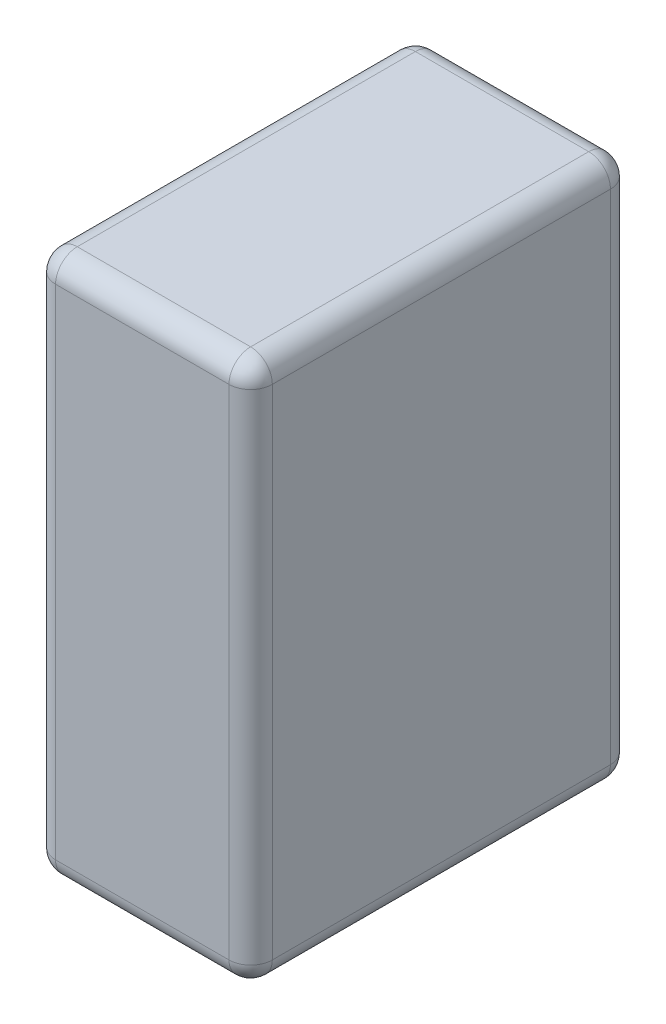
ISO-10303-21;
HEADER;
FILE_DESCRIPTION(('STEP AP214'),'2;1');
FILE_NAME('part.step','',(''),(''),'','','');
FILE_SCHEMA(('AUTOMOTIVE_DESIGN { 1 0 10303 214 1 1 1 1 }'));
ENDSEC;
DATA;
#1=APPLICATION_CONTEXT('core data for automotive mechanical design processes');
#2=APPLICATION_PROTOCOL_DEFINITION('international standard','automotive_design',2000,#1);
#3=PRODUCT_CONTEXT('',#1,'mechanical');
#4=PRODUCT('Part','Part','',(#3));
#5=PRODUCT_RELATED_PRODUCT_CATEGORY('part','',(#4));
#6=PRODUCT_DEFINITION_FORMATION('','',#4);
#7=PRODUCT_DEFINITION_CONTEXT('part definition',#1,'design');
#8=PRODUCT_DEFINITION('design','',#6,#7);
#9=PRODUCT_DEFINITION_SHAPE('','',#8);
#10=(LENGTH_UNIT() NAMED_UNIT(*) SI_UNIT(.MILLI.,.METRE.));
#11=(NAMED_UNIT(*) PLANE_ANGLE_UNIT() SI_UNIT($,.RADIAN.));
#12=(NAMED_UNIT(*) SI_UNIT($,.STERADIAN.) SOLID_ANGLE_UNIT());
#13=UNCERTAINTY_MEASURE_WITH_UNIT(LENGTH_MEASURE(1.E-05),#10,'distance_accuracy_value','');
#14=(GEOMETRIC_REPRESENTATION_CONTEXT(3) GLOBAL_UNCERTAINTY_ASSIGNED_CONTEXT((#13)) GLOBAL_UNIT_ASSIGNED_CONTEXT((#10,
#11,#12)) REPRESENTATION_CONTEXT('',''));
#15=CARTESIAN_POINT('',(0.,0.,0.));
#16=DIRECTION('',(0.,0.,1.));
#17=DIRECTION('',(1.,0.,0.));
#18=AXIS2_PLACEMENT_3D('',#15,#16,#17);
#19=CARTESIAN_POINT('',(-1.,-0.625,0.));
#20=DIRECTION('',(1.,0.,0.));
#21=DIRECTION('',(0.,0.,1.));
#22=AXIS2_PLACEMENT_3D('',#19,#20,#21);
#23=PLANE('',#22);
#24=DIRECTION('',(0.,1.,0.));
#25=VECTOR('',#24,1.);
#26=CARTESIAN_POINT('',(-1.,-0.575,0.83));
#27=LINE('',#26,#25);
#28=CARTESIAN_POINT('',(-1.,-0.575,0.83));
#29=VERTEX_POINT('',#28);
#30=CARTESIAN_POINT('',(-1.,0.575,0.83));
#31=VERTEX_POINT('',#30);
#32=EDGE_CURVE('E11',#29,#31,#27,.T.);
#33=ORIENTED_EDGE('',*,*,#32,.T.);
#34=DIRECTION('',(0.,0.,1.));
#35=VECTOR('',#34,1.);
#36=CARTESIAN_POINT('',(-1.,0.575,0.05));
#37=LINE('',#36,#35);
#38=CARTESIAN_POINT('',(-1.,0.575,0.05));
#39=VERTEX_POINT('',#38);
#40=EDGE_CURVE('E241',#39,#31,#37,.T.);
#41=ORIENTED_EDGE('',*,*,#40,.F.);
#42=DIRECTION('',(0.,1.,0.));
#43=VECTOR('',#42,1.);
#44=CARTESIAN_POINT('',(-1.,-0.575,0.05));
#45=LINE('',#44,#43);
#46=CARTESIAN_POINT('',(-1.,-0.575,0.05));
#47=VERTEX_POINT('',#46);
#48=EDGE_CURVE('E238',#47,#39,#45,.T.);
#49=ORIENTED_EDGE('',*,*,#48,.F.);
#50=DIRECTION('',(0.,0.,1.));
#51=VECTOR('',#50,1.);
#52=CARTESIAN_POINT('',(-1.,-0.575,0.05));
#53=LINE('',#52,#51);
#54=EDGE_CURVE('E24',#47,#29,#53,.T.);
#55=ORIENTED_EDGE('',*,*,#54,.T.);
#56=EDGE_LOOP('',(#33,#41,#49,#55));
#57=FACE_BOUND('',#56,.T.);
#58=ADVANCED_FACE('F17',(#57),#23,.F.);
#59=CARTESIAN_POINT('',(-0.95,-0.575,0.));
#60=DIRECTION('',(0.,0.,1.));
#61=DIRECTION('',(-1.,0.,0.));
#62=AXIS2_PLACEMENT_3D('',#59,#60,#61);
#63=CYLINDRICAL_SURFACE('',#62,0.05);
#64=ORIENTED_EDGE('',*,*,#54,.F.);
#65=CARTESIAN_POINT('',(-0.95,-0.575,0.05));
#66=DIRECTION('',(0.,0.,1.));
#67=DIRECTION('',(-1.,0.,0.));
#68=AXIS2_PLACEMENT_3D('',#65,#66,#67);
#69=CIRCLE('',#68,0.05);
#70=CARTESIAN_POINT('',(-0.95,-0.625,0.05));
#71=VERTEX_POINT('',#70);
#72=EDGE_CURVE('E236',#47,#71,#69,.T.);
#73=ORIENTED_EDGE('',*,*,#72,.T.);
#74=DIRECTION('',(0.,0.,1.));
#75=VECTOR('',#74,1.);
#76=CARTESIAN_POINT('',(-0.95,-0.625,0.05));
#77=LINE('',#76,#75);
#78=CARTESIAN_POINT('',(-0.95,-0.625,0.83));
#79=VERTEX_POINT('',#78);
#80=EDGE_CURVE('E228',#71,#79,#77,.T.);
#81=ORIENTED_EDGE('',*,*,#80,.T.);
#82=CARTESIAN_POINT('',(-0.95,-0.575,0.83));
#83=DIRECTION('',(0.,0.,1.));
#84=DIRECTION('',(-1.,0.,0.));
#85=AXIS2_PLACEMENT_3D('',#82,#83,#84);
#86=CIRCLE('',#85,0.05);
#87=EDGE_CURVE('E217',#29,#79,#86,.T.);
#88=ORIENTED_EDGE('',*,*,#87,.F.);
#89=EDGE_LOOP('',(#64,#73,#81,#88));
#90=FACE_BOUND('',#89,.T.);
#91=ADVANCED_FACE('F243',(#90),#63,.T.);
#92=CARTESIAN_POINT('',(-0.95,-0.625,0.05));
#93=DIRECTION('',(0.,1.,0.));
#94=DIRECTION('',(-1.,0.,0.));
#95=AXIS2_PLACEMENT_3D('',#92,#93,#94);
#96=CYLINDRICAL_SURFACE('',#95,0.05);
#97=ORIENTED_EDGE('',*,*,#48,.T.);
#98=CARTESIAN_POINT('',(-0.95,0.575,0.05));
#99=DIRECTION('',(0.,1.,0.));
#100=DIRECTION('',(0.,0.,-1.));
#101=AXIS2_PLACEMENT_3D('',#98,#99,#100);
#102=CIRCLE('',#101,0.05);
#103=CARTESIAN_POINT('',(-0.95,0.575,0.));
#104=VERTEX_POINT('',#103);
#105=EDGE_CURVE('E230',#104,#39,#102,.T.);
#106=ORIENTED_EDGE('',*,*,#105,.F.);
#107=DIRECTION('',(0.,1.,0.));
#108=VECTOR('',#107,1.);
#109=CARTESIAN_POINT('',(-0.95,-0.575,0.));
#110=LINE('',#109,#108);
#111=CARTESIAN_POINT('',(-0.95,-0.575,0.));
#112=VERTEX_POINT('',#111);
#113=EDGE_CURVE('E220',#112,#104,#110,.T.);
#114=ORIENTED_EDGE('',*,*,#113,.F.);
#115=CARTESIAN_POINT('',(-0.95,-0.575,0.05));
#116=DIRECTION('',(0.,1.,0.));
#117=DIRECTION('',(0.,0.,-1.));
#118=AXIS2_PLACEMENT_3D('',#115,#116,#117);
#119=CIRCLE('',#118,0.05);
#120=EDGE_CURVE('E205',#112,#47,#119,.T.);
#121=ORIENTED_EDGE('',*,*,#120,.T.);
#122=EDGE_LOOP('',(#97,#106,#114,#121));
#123=FACE_BOUND('',#122,.T.);
#124=ADVANCED_FACE('F270',(#123),#96,.T.);
#125=CARTESIAN_POINT('',(-0.95,-0.625,0.83));
#126=DIRECTION('',(0.,1.,0.));
#127=DIRECTION('',(-1.,0.,0.));
#128=AXIS2_PLACEMENT_3D('',#125,#126,#127);
#129=CYLINDRICAL_SURFACE('',#128,0.05);
#130=CARTESIAN_POINT('',(-0.95,-0.575,0.83));
#131=DIRECTION('',(0.,-1.,0.));
#132=DIRECTION('',(0.,0.,1.));
#133=AXIS2_PLACEMENT_3D('',#130,#131,#132);
#134=CIRCLE('',#133,0.05);
#135=CARTESIAN_POINT('',(-0.95,-0.575,0.88));
#136=VERTEX_POINT('',#135);
#137=EDGE_CURVE('E233',#136,#29,#134,.T.);
#138=ORIENTED_EDGE('',*,*,#137,.F.);
#139=DIRECTION('',(0.,1.,0.));
#140=VECTOR('',#139,1.);
#141=CARTESIAN_POINT('',(-0.95,-0.575,0.88));
#142=LINE('',#141,#140);
#143=CARTESIAN_POINT('',(-0.95,0.575,0.88));
#144=VERTEX_POINT('',#143);
#145=EDGE_CURVE('E223',#136,#144,#142,.T.);
#146=ORIENTED_EDGE('',*,*,#145,.T.);
#147=CARTESIAN_POINT('',(-0.95,0.575,0.83));
#148=DIRECTION('',(0.,1.,0.));
#149=DIRECTION('',(-1.,0.,0.));
#150=AXIS2_PLACEMENT_3D('',#147,#148,#149);
#151=CIRCLE('',#150,0.05);
#152=EDGE_CURVE('E208',#31,#144,#151,.T.);
#153=ORIENTED_EDGE('',*,*,#152,.F.);
#154=ORIENTED_EDGE('',*,*,#32,.F.);
#155=EDGE_LOOP('',(#138,#146,#153,#154));
#156=FACE_BOUND('',#155,.T.);
#157=ADVANCED_FACE('F251',(#156),#129,.T.);
#158=CARTESIAN_POINT('',(-0.95,0.575,0.));
#159=DIRECTION('',(0.,0.,1.));
#160=DIRECTION('',(-1.,0.,0.));
#161=AXIS2_PLACEMENT_3D('',#158,#159,#160);
#162=CYLINDRICAL_SURFACE('',#161,0.05);
#163=CARTESIAN_POINT('',(-0.95,0.575,0.83));
#164=DIRECTION('',(0.,0.,1.));
#165=DIRECTION('',(0.,1.,0.));
#166=AXIS2_PLACEMENT_3D('',#163,#164,#165);
#167=CIRCLE('',#166,0.05);
#168=CARTESIAN_POINT('',(-0.95,0.625,0.83));
#169=VERTEX_POINT('',#168);
#170=EDGE_CURVE('E225',#169,#31,#167,.T.);
#171=ORIENTED_EDGE('',*,*,#170,.F.);
#172=DIRECTION('',(0.,0.,1.));
#173=VECTOR('',#172,1.);
#174=CARTESIAN_POINT('',(-0.95,0.625,0.05));
#175=LINE('',#174,#173);
#176=CARTESIAN_POINT('',(-0.95,0.625,0.05));
#177=VERTEX_POINT('',#176);
#178=EDGE_CURVE('E211',#177,#169,#175,.T.);
#179=ORIENTED_EDGE('',*,*,#178,.F.);
#180=CARTESIAN_POINT('',(-0.95,0.575,0.05));
#181=DIRECTION('',(0.,0.,-1.));
#182=DIRECTION('',(-1.,0.,0.));
#183=AXIS2_PLACEMENT_3D('',#180,#181,#182);
#184=CIRCLE('',#183,0.05);
#185=EDGE_CURVE('E202',#39,#177,#184,.T.);
#186=ORIENTED_EDGE('',*,*,#185,.F.);
#187=ORIENTED_EDGE('',*,*,#40,.T.);
#188=EDGE_LOOP('',(#171,#179,#186,#187));
#189=FACE_BOUND('',#188,.T.);
#190=ADVANCED_FACE('F257',(#189),#162,.T.);
#191=CARTESIAN_POINT('',(-0.95,-0.575,0.05));
#192=DIRECTION('',(0.,0.,1.));
#193=DIRECTION('',(-1.,0.,0.));
#194=AXIS2_PLACEMENT_3D('',#191,#192,#193);
#195=SPHERICAL_SURFACE('',#194,0.05);
#196=CARTESIAN_POINT('',(-0.95,-0.575,0.05));
#197=DIRECTION('',(-1.,0.,0.));
#198=DIRECTION('',(0.,0.,-1.));
#199=AXIS2_PLACEMENT_3D('',#196,#197,#198);
#200=CIRCLE('',#199,0.05);
#201=EDGE_CURVE('E214',#112,#71,#200,.T.);
#202=ORIENTED_EDGE('',*,*,#201,.T.);
#203=ORIENTED_EDGE('',*,*,#72,.F.);
#204=ORIENTED_EDGE('',*,*,#120,.F.);
#205=EDGE_LOOP('',(#202,#203,#204));
#206=FACE_BOUND('',#205,.T.);
#207=ADVANCED_FACE('F275',(#206),#195,.T.);
#208=CARTESIAN_POINT('',(-0.95,-0.575,0.83));
#209=DIRECTION('',(0.,0.,-1.));
#210=DIRECTION('',(-1.,0.,0.));
#211=AXIS2_PLACEMENT_3D('',#208,#209,#210);
#212=SPHERICAL_SURFACE('',#211,0.05);
#213=ORIENTED_EDGE('',*,*,#137,.T.);
#214=ORIENTED_EDGE('',*,*,#87,.T.);
#215=CARTESIAN_POINT('',(-0.95,-0.575,0.83));
#216=DIRECTION('',(1.,0.,0.));
#217=DIRECTION('',(0.,0.,1.));
#218=AXIS2_PLACEMENT_3D('',#215,#216,#217);
#219=CIRCLE('',#218,0.05);
#220=EDGE_CURVE('E193',#136,#79,#219,.T.);
#221=ORIENTED_EDGE('',*,*,#220,.F.);
#222=EDGE_LOOP('',(#213,#214,#221));
#223=FACE_BOUND('',#222,.T.);
#224=ADVANCED_FACE('F248',(#223),#212,.T.);
#225=CARTESIAN_POINT('',(-1.,-0.625,0.));
#226=DIRECTION('',(0.,1.,0.));
#227=DIRECTION('',(0.,0.,1.));
#228=AXIS2_PLACEMENT_3D('',#225,#226,#227);
#229=PLANE('',#228);
#230=DIRECTION('',(1.,0.,0.));
#231=VECTOR('',#230,1.);
#232=CARTESIAN_POINT('',(-0.95,-0.625,0.05));
#233=LINE('',#232,#231);
#234=CARTESIAN_POINT('',(-0.55,-0.625,0.05));
#235=VERTEX_POINT('',#234);
#236=EDGE_CURVE('E200',#71,#235,#233,.T.);
#237=ORIENTED_EDGE('',*,*,#236,.T.);
#238=DIRECTION('',(0.,0.,1.));
#239=VECTOR('',#238,1.);
#240=CARTESIAN_POINT('',(-0.55,-0.625,0.05));
#241=LINE('',#240,#239);
#242=CARTESIAN_POINT('',(-0.55,-0.625,0.83));
#243=VERTEX_POINT('',#242);
#244=EDGE_CURVE('E196',#235,#243,#241,.T.);
#245=ORIENTED_EDGE('',*,*,#244,.T.);
#246=DIRECTION('',(1.,0.,0.));
#247=VECTOR('',#246,1.);
#248=CARTESIAN_POINT('',(-0.95,-0.625,0.83));
#249=LINE('',#248,#247);
#250=EDGE_CURVE('E186',#79,#243,#249,.T.);
#251=ORIENTED_EDGE('',*,*,#250,.F.);
#252=ORIENTED_EDGE('',*,*,#80,.F.);
#253=EDGE_LOOP('',(#237,#245,#251,#252));
#254=FACE_BOUND('',#253,.T.);
#255=ADVANCED_FACE('F280',(#254),#229,.F.);
#256=CARTESIAN_POINT('',(-1.,-0.625,0.));
#257=DIRECTION('',(0.,0.,1.));
#258=DIRECTION('',(1.,0.,0.));
#259=AXIS2_PLACEMENT_3D('',#256,#257,#258);
#260=PLANE('',#259);
#261=DIRECTION('',(1.,0.,0.));
#262=VECTOR('',#261,1.);
#263=CARTESIAN_POINT('',(-0.95,0.575,0.));
#264=LINE('',#263,#262);
#265=CARTESIAN_POINT('',(-0.55,0.575,0.));
#266=VERTEX_POINT('',#265);
#267=EDGE_CURVE('E198',#104,#266,#264,.T.);
#268=ORIENTED_EDGE('',*,*,#267,.T.);
#269=DIRECTION('',(0.,1.,0.));
#270=VECTOR('',#269,1.);
#271=CARTESIAN_POINT('',(-0.55,-0.575,0.));
#272=LINE('',#271,#270);
#273=CARTESIAN_POINT('',(-0.55,-0.575,0.));
#274=VERTEX_POINT('',#273);
#275=EDGE_CURVE('E110',#274,#266,#272,.T.);
#276=ORIENTED_EDGE('',*,*,#275,.F.);
#277=DIRECTION('',(1.,0.,0.));
#278=VECTOR('',#277,1.);
#279=CARTESIAN_POINT('',(-0.95,-0.575,0.));
#280=LINE('',#279,#278);
#281=EDGE_CURVE('E183',#112,#274,#280,.T.);
#282=ORIENTED_EDGE('',*,*,#281,.F.);
#283=ORIENTED_EDGE('',*,*,#113,.T.);
#284=EDGE_LOOP('',(#268,#276,#282,#283));
#285=FACE_BOUND('',#284,.T.);
#286=ADVANCED_FACE('F322',(#285),#260,.F.);
#287=CARTESIAN_POINT('',(-0.95,0.575,0.05));
#288=DIRECTION('',(0.,0.,1.));
#289=DIRECTION('',(-1.,0.,0.));
#290=AXIS2_PLACEMENT_3D('',#287,#288,#289);
#291=SPHERICAL_SURFACE('',#290,0.05);
#292=CARTESIAN_POINT('',(-0.95,0.575,0.05));
#293=DIRECTION('',(1.,0.,0.));
#294=DIRECTION('',(0.,0.,-1.));
#295=AXIS2_PLACEMENT_3D('',#292,#293,#294);
#296=CIRCLE('',#295,0.05);
#297=EDGE_CURVE('E190',#104,#177,#296,.T.);
#298=ORIENTED_EDGE('',*,*,#297,.F.);
#299=ORIENTED_EDGE('',*,*,#105,.T.);
#300=ORIENTED_EDGE('',*,*,#185,.T.);
#301=EDGE_LOOP('',(#298,#299,#300));
#302=FACE_BOUND('',#301,.T.);
#303=ADVANCED_FACE('F268',(#302),#291,.T.);
#304=CARTESIAN_POINT('',(-1.,-0.625,0.88));
#305=DIRECTION('',(0.,0.,1.));
#306=DIRECTION('',(1.,0.,0.));
#307=AXIS2_PLACEMENT_3D('',#304,#305,#306);
#308=PLANE('',#307);
#309=ORIENTED_EDGE('',*,*,#145,.F.);
#310=DIRECTION('',(1.,0.,0.));
#311=VECTOR('',#310,1.);
#312=CARTESIAN_POINT('',(-0.95,-0.575,0.88));
#313=LINE('',#312,#311);
#314=CARTESIAN_POINT('',(-0.55,-0.575,0.88));
#315=VERTEX_POINT('',#314);
#316=EDGE_CURVE('E181',#136,#315,#313,.T.);
#317=ORIENTED_EDGE('',*,*,#316,.T.);
#318=DIRECTION('',(0.,1.,0.));
#319=VECTOR('',#318,1.);
#320=CARTESIAN_POINT('',(-0.55,-0.575,0.88));
#321=LINE('',#320,#319);
#322=CARTESIAN_POINT('',(-0.55,0.575,0.88));
#323=VERTEX_POINT('',#322);
#324=EDGE_CURVE('E179',#315,#323,#321,.T.);
#325=ORIENTED_EDGE('',*,*,#324,.T.);
#326=DIRECTION('',(1.,0.,0.));
#327=VECTOR('',#326,1.);
#328=CARTESIAN_POINT('',(-0.95,0.575,0.88));
#329=LINE('',#328,#327);
#330=EDGE_CURVE('E171',#144,#323,#329,.T.);
#331=ORIENTED_EDGE('',*,*,#330,.F.);
#332=EDGE_LOOP('',(#309,#317,#325,#331));
#333=FACE_BOUND('',#332,.T.);
#334=ADVANCED_FACE('F321',(#333),#308,.T.);
#335=CARTESIAN_POINT('',(-0.95,0.575,0.83));
#336=DIRECTION('',(0.,-1.,0.));
#337=DIRECTION('',(-1.,0.,0.));
#338=AXIS2_PLACEMENT_3D('',#335,#336,#337);
#339=SPHERICAL_SURFACE('',#338,0.05);
#340=ORIENTED_EDGE('',*,*,#170,.T.);
#341=ORIENTED_EDGE('',*,*,#152,.T.);
#342=CARTESIAN_POINT('',(-0.95,0.575,0.83));
#343=DIRECTION('',(1.,0.,0.));
#344=DIRECTION('',(0.,1.,0.));
#345=AXIS2_PLACEMENT_3D('',#342,#343,#344);
#346=CIRCLE('',#345,0.05);
#347=EDGE_CURVE('E174',#169,#144,#346,.T.);
#348=ORIENTED_EDGE('',*,*,#347,.F.);
#349=EDGE_LOOP('',(#340,#341,#348));
#350=FACE_BOUND('',#349,.T.);
#351=ADVANCED_FACE('F258',(#350),#339,.T.);
#352=CARTESIAN_POINT('',(-1.,0.625,0.));
#353=DIRECTION('',(0.,1.,0.));
#354=DIRECTION('',(0.,0.,1.));
#355=AXIS2_PLACEMENT_3D('',#352,#353,#354);
#356=PLANE('',#355);
#357=ORIENTED_EDGE('',*,*,#178,.T.);
#358=DIRECTION('',(1.,0.,0.));
#359=VECTOR('',#358,1.);
#360=CARTESIAN_POINT('',(-0.95,0.625,0.83));
#361=LINE('',#360,#359);
#362=CARTESIAN_POINT('',(-0.55,0.625,0.83));
#363=VERTEX_POINT('',#362);
#364=EDGE_CURVE('E177',#169,#363,#361,.T.);
#365=ORIENTED_EDGE('',*,*,#364,.T.);
#366=DIRECTION('',(0.,0.,1.));
#367=VECTOR('',#366,1.);
#368=CARTESIAN_POINT('',(-0.55,0.625,0.05));
#369=LINE('',#368,#367);
#370=CARTESIAN_POINT('',(-0.55,0.625,0.05));
#371=VERTEX_POINT('',#370);
#372=EDGE_CURVE('E169',#371,#363,#369,.T.);
#373=ORIENTED_EDGE('',*,*,#372,.F.);
#374=DIRECTION('',(1.,0.,0.));
#375=VECTOR('',#374,1.);
#376=CARTESIAN_POINT('',(-0.95,0.625,0.05));
#377=LINE('',#376,#375);
#378=EDGE_CURVE('E157',#177,#371,#377,.T.);
#379=ORIENTED_EDGE('',*,*,#378,.F.);
#380=EDGE_LOOP('',(#357,#365,#373,#379));
#381=FACE_BOUND('',#380,.T.);
#382=ADVANCED_FACE('F264',(#381),#356,.T.);
#383=CARTESIAN_POINT('',(-1.,-0.575,0.05));
#384=DIRECTION('',(1.,0.,0.));
#385=DIRECTION('',(0.,-1.,0.));
#386=AXIS2_PLACEMENT_3D('',#383,#384,#385);
#387=CYLINDRICAL_SURFACE('',#386,0.05);
#388=ORIENTED_EDGE('',*,*,#201,.F.);
#389=ORIENTED_EDGE('',*,*,#281,.T.);
#390=CARTESIAN_POINT('',(-0.55,-0.575,0.05));
#391=DIRECTION('',(-1.,0.,0.));
#392=DIRECTION('',(0.,0.,-1.));
#393=AXIS2_PLACEMENT_3D('',#390,#391,#392);
#394=CIRCLE('',#393,0.05);
#395=EDGE_CURVE('E160',#274,#235,#394,.T.);
#396=ORIENTED_EDGE('',*,*,#395,.T.);
#397=ORIENTED_EDGE('',*,*,#236,.F.);
#398=EDGE_LOOP('',(#388,#389,#396,#397));
#399=FACE_BOUND('',#398,.T.);
#400=ADVANCED_FACE('F281',(#399),#387,.T.);
#401=CARTESIAN_POINT('',(-1.,-0.575,0.83));
#402=DIRECTION('',(1.,0.,0.));
#403=DIRECTION('',(0.,-1.,0.));
#404=AXIS2_PLACEMENT_3D('',#401,#402,#403);
#405=CYLINDRICAL_SURFACE('',#404,0.05);
#406=ORIENTED_EDGE('',*,*,#250,.T.);
#407=CARTESIAN_POINT('',(-0.55,-0.575,0.83));
#408=DIRECTION('',(1.,0.,0.));
#409=DIRECTION('',(0.,0.,1.));
#410=AXIS2_PLACEMENT_3D('',#407,#408,#409);
#411=CIRCLE('',#410,0.05);
#412=EDGE_CURVE('E163',#315,#243,#411,.T.);
#413=ORIENTED_EDGE('',*,*,#412,.F.);
#414=ORIENTED_EDGE('',*,*,#316,.F.);
#415=ORIENTED_EDGE('',*,*,#220,.T.);
#416=EDGE_LOOP('',(#406,#413,#414,#415));
#417=FACE_BOUND('',#416,.T.);
#418=ADVANCED_FACE('F335',(#417),#405,.T.);
#419=CARTESIAN_POINT('',(-0.55,-0.575,0.));
#420=DIRECTION('',(0.,0.,1.));
#421=DIRECTION('',(1.,0.,0.));
#422=AXIS2_PLACEMENT_3D('',#419,#420,#421);
#423=CYLINDRICAL_SURFACE('',#422,0.05);
#424=CARTESIAN_POINT('',(-0.55,-0.575,0.83));
#425=DIRECTION('',(0.,0.,-1.));
#426=DIRECTION('',(1.,0.,0.));
#427=AXIS2_PLACEMENT_3D('',#424,#425,#426);
#428=CIRCLE('',#427,0.05);
#429=CARTESIAN_POINT('',(-0.5,-0.575,0.83));
#430=VERTEX_POINT('',#429);
#431=EDGE_CURVE('E166',#430,#243,#428,.T.);
#432=ORIENTED_EDGE('',*,*,#431,.T.);
#433=ORIENTED_EDGE('',*,*,#244,.F.);
#434=CARTESIAN_POINT('',(-0.55,-0.575,0.05));
#435=DIRECTION('',(0.,0.,-1.));
#436=DIRECTION('',(1.,0.,0.));
#437=AXIS2_PLACEMENT_3D('',#434,#435,#436);
#438=CIRCLE('',#437,0.05);
#439=CARTESIAN_POINT('',(-0.5,-0.575,0.05));
#440=VERTEX_POINT('',#439);
#441=EDGE_CURVE('E151',#440,#235,#438,.T.);
#442=ORIENTED_EDGE('',*,*,#441,.F.);
#443=DIRECTION('',(0.,0.,1.));
#444=VECTOR('',#443,1.);
#445=CARTESIAN_POINT('',(-0.5,-0.575,0.05));
#446=LINE('',#445,#444);
#447=EDGE_CURVE('E132',#440,#430,#446,.T.);
#448=ORIENTED_EDGE('',*,*,#447,.T.);
#449=EDGE_LOOP('',(#432,#433,#442,#448));
#450=FACE_BOUND('',#449,.T.);
#451=ADVANCED_FACE('F286',(#450),#423,.T.);
#452=CARTESIAN_POINT('',(-1.,0.575,0.05));
#453=DIRECTION('',(1.,0.,0.));
#454=DIRECTION('',(0.,1.,0.));
#455=AXIS2_PLACEMENT_3D('',#452,#453,#454);
#456=CYLINDRICAL_SURFACE('',#455,0.05);
#457=ORIENTED_EDGE('',*,*,#378,.T.);
#458=CARTESIAN_POINT('',(-0.55,0.575,0.05));
#459=DIRECTION('',(1.,0.,0.));
#460=DIRECTION('',(0.,0.,-1.));
#461=AXIS2_PLACEMENT_3D('',#458,#459,#460);
#462=CIRCLE('',#461,0.05);
#463=EDGE_CURVE('E138',#266,#371,#462,.T.);
#464=ORIENTED_EDGE('',*,*,#463,.F.);
#465=ORIENTED_EDGE('',*,*,#267,.F.);
#466=ORIENTED_EDGE('',*,*,#297,.T.);
#467=EDGE_LOOP('',(#457,#464,#465,#466));
#468=FACE_BOUND('',#467,.T.);
#469=ADVANCED_FACE('F338',(#468),#456,.T.);
#470=CARTESIAN_POINT('',(-0.55,-0.625,0.05));
#471=DIRECTION('',(0.,1.,0.));
#472=DIRECTION('',(1.,0.,0.));
#473=AXIS2_PLACEMENT_3D('',#470,#471,#472);
#474=CYLINDRICAL_SURFACE('',#473,0.05);
#475=CARTESIAN_POINT('',(-0.55,-0.575,0.05));
#476=DIRECTION('',(0.,-1.,0.));
#477=DIRECTION('',(0.,0.,-1.));
#478=AXIS2_PLACEMENT_3D('',#475,#476,#477);
#479=CIRCLE('',#478,0.05);
#480=EDGE_CURVE('E155',#274,#440,#479,.T.);
#481=ORIENTED_EDGE('',*,*,#480,.F.);
#482=ORIENTED_EDGE('',*,*,#275,.T.);
#483=CARTESIAN_POINT('',(-0.55,0.575,0.05));
#484=DIRECTION('',(0.,-1.,0.));
#485=DIRECTION('',(0.,0.,-1.));
#486=AXIS2_PLACEMENT_3D('',#483,#484,#485);
#487=CIRCLE('',#486,0.05);
#488=CARTESIAN_POINT('',(-0.5,0.575,0.05));
#489=VERTEX_POINT('',#488);
#490=EDGE_CURVE('E103',#266,#489,#487,.T.);
#491=ORIENTED_EDGE('',*,*,#490,.T.);
#492=DIRECTION('',(0.,1.,0.));
#493=VECTOR('',#492,1.);
#494=CARTESIAN_POINT('',(-0.5,-0.575,0.05));
#495=LINE('',#494,#493);
#496=EDGE_CURVE('E108',#440,#489,#495,.T.);
#497=ORIENTED_EDGE('',*,*,#496,.F.);
#498=EDGE_LOOP('',(#481,#482,#491,#497));
#499=FACE_BOUND('',#498,.T.);
#500=ADVANCED_FACE('F106',(#499),#474,.T.);
#501=CARTESIAN_POINT('',(-1.,0.575,0.83));
#502=DIRECTION('',(1.,0.,0.));
#503=DIRECTION('',(0.,1.,0.));
#504=AXIS2_PLACEMENT_3D('',#501,#502,#503);
#505=CYLINDRICAL_SURFACE('',#504,0.05);
#506=ORIENTED_EDGE('',*,*,#347,.T.);
#507=ORIENTED_EDGE('',*,*,#330,.T.);
#508=CARTESIAN_POINT('',(-0.55,0.575,0.83));
#509=DIRECTION('',(1.,0.,0.));
#510=DIRECTION('',(0.,1.,0.));
#511=AXIS2_PLACEMENT_3D('',#508,#509,#510);
#512=CIRCLE('',#511,0.05);
#513=EDGE_CURVE('E134',#363,#323,#512,.T.);
#514=ORIENTED_EDGE('',*,*,#513,.F.);
#515=ORIENTED_EDGE('',*,*,#364,.F.);
#516=EDGE_LOOP('',(#506,#507,#514,#515));
#517=FACE_BOUND('',#516,.T.);
#518=ADVANCED_FACE('F262',(#517),#505,.T.);
#519=CARTESIAN_POINT('',(-0.55,-0.625,0.83));
#520=DIRECTION('',(0.,1.,0.));
#521=DIRECTION('',(1.,0.,0.));
#522=AXIS2_PLACEMENT_3D('',#519,#520,#521);
#523=CYLINDRICAL_SURFACE('',#522,0.05);
#524=DIRECTION('',(0.,1.,0.));
#525=VECTOR('',#524,1.);
#526=CARTESIAN_POINT('',(-0.5,-0.575,0.83));
#527=LINE('',#526,#525);
#528=CARTESIAN_POINT('',(-0.5,0.575,0.83));
#529=VERTEX_POINT('',#528);
#530=EDGE_CURVE('E114',#430,#529,#527,.T.);
#531=ORIENTED_EDGE('',*,*,#530,.T.);
#532=CARTESIAN_POINT('',(-0.55,0.575,0.83));
#533=DIRECTION('',(0.,-1.,0.));
#534=DIRECTION('',(1.,0.,0.));
#535=AXIS2_PLACEMENT_3D('',#532,#533,#534);
#536=CIRCLE('',#535,0.05);
#537=EDGE_CURVE('E129',#529,#323,#536,.T.);
#538=ORIENTED_EDGE('',*,*,#537,.T.);
#539=ORIENTED_EDGE('',*,*,#324,.F.);
#540=CARTESIAN_POINT('',(-0.55,-0.575,0.83));
#541=DIRECTION('',(0.,1.,0.));
#542=DIRECTION('',(0.,0.,1.));
#543=AXIS2_PLACEMENT_3D('',#540,#541,#542);
#544=CIRCLE('',#543,0.05);
#545=EDGE_CURVE('E139',#315,#430,#544,.T.);
#546=ORIENTED_EDGE('',*,*,#545,.T.);
#547=EDGE_LOOP('',(#531,#538,#539,#546));
#548=FACE_BOUND('',#547,.T.);
#549=ADVANCED_FACE('F299',(#548),#523,.T.);
#550=CARTESIAN_POINT('',(-0.55,0.575,0.));
#551=DIRECTION('',(0.,0.,1.));
#552=DIRECTION('',(1.,0.,0.));
#553=AXIS2_PLACEMENT_3D('',#550,#551,#552);
#554=CYLINDRICAL_SURFACE('',#553,0.05);
#555=DIRECTION('',(0.,0.,1.));
#556=VECTOR('',#555,1.);
#557=CARTESIAN_POINT('',(-0.5,0.575,0.05));
#558=LINE('',#557,#556);
#559=EDGE_CURVE('E115',#489,#529,#558,.T.);
#560=ORIENTED_EDGE('',*,*,#559,.F.);
#561=CARTESIAN_POINT('',(-0.55,0.575,0.05));
#562=DIRECTION('',(0.,0.,1.));
#563=DIRECTION('',(1.,0.,0.));
#564=AXIS2_PLACEMENT_3D('',#561,#562,#563);
#565=CIRCLE('',#564,0.05);
#566=EDGE_CURVE('E123',#489,#371,#565,.T.);
#567=ORIENTED_EDGE('',*,*,#566,.T.);
#568=ORIENTED_EDGE('',*,*,#372,.T.);
#569=CARTESIAN_POINT('',(-0.55,0.575,0.83));
#570=DIRECTION('',(0.,0.,-1.));
#571=DIRECTION('',(0.,1.,0.));
#572=AXIS2_PLACEMENT_3D('',#569,#570,#571);
#573=CIRCLE('',#572,0.05);
#574=EDGE_CURVE('E125',#363,#529,#573,.T.);
#575=ORIENTED_EDGE('',*,*,#574,.T.);
#576=EDGE_LOOP('',(#560,#567,#568,#575));
#577=FACE_BOUND('',#576,.T.);
#578=ADVANCED_FACE('F121',(#577),#554,.T.);
#579=CARTESIAN_POINT('',(-0.55,-0.575,0.05));
#580=DIRECTION('',(0.,0.,1.));
#581=DIRECTION('',(1.,0.,0.));
#582=AXIS2_PLACEMENT_3D('',#579,#580,#581);
#583=SPHERICAL_SURFACE('',#582,0.05);
#584=ORIENTED_EDGE('',*,*,#441,.T.);
#585=ORIENTED_EDGE('',*,*,#395,.F.);
#586=ORIENTED_EDGE('',*,*,#480,.T.);
#587=EDGE_LOOP('',(#584,#585,#586));
#588=FACE_BOUND('',#587,.T.);
#589=ADVANCED_FACE('F288',(#588),#583,.T.);
#590=CARTESIAN_POINT('',(-0.55,-0.575,0.83));
#591=DIRECTION('',(0.,0.,-1.));
#592=DIRECTION('',(1.,0.,0.));
#593=AXIS2_PLACEMENT_3D('',#590,#591,#592);
#594=SPHERICAL_SURFACE('',#593,0.05);
#595=ORIENTED_EDGE('',*,*,#545,.F.);
#596=ORIENTED_EDGE('',*,*,#412,.T.);
#597=ORIENTED_EDGE('',*,*,#431,.F.);
#598=EDGE_LOOP('',(#595,#596,#597));
#599=FACE_BOUND('',#598,.T.);
#600=ADVANCED_FACE('F290',(#599),#594,.T.);
#601=CARTESIAN_POINT('',(-0.5,-0.625,0.));
#602=DIRECTION('',(1.,0.,0.));
#603=DIRECTION('',(0.,0.,1.));
#604=AXIS2_PLACEMENT_3D('',#601,#602,#603);
#605=PLANE('',#604);
#606=ORIENTED_EDGE('',*,*,#447,.F.);
#607=ORIENTED_EDGE('',*,*,#496,.T.);
#608=ORIENTED_EDGE('',*,*,#559,.T.);
#609=ORIENTED_EDGE('',*,*,#530,.F.);
#610=EDGE_LOOP('',(#606,#607,#608,#609));
#611=FACE_BOUND('',#610,.T.);
#612=ADVANCED_FACE('F131',(#611),#605,.T.);
#613=CARTESIAN_POINT('',(-0.55,0.575,0.05));
#614=DIRECTION('',(0.,0.,1.));
#615=DIRECTION('',(1.,0.,0.));
#616=AXIS2_PLACEMENT_3D('',#613,#614,#615);
#617=SPHERICAL_SURFACE('',#616,0.05);
#618=ORIENTED_EDGE('',*,*,#490,.F.);
#619=ORIENTED_EDGE('',*,*,#463,.T.);
#620=ORIENTED_EDGE('',*,*,#566,.F.);
#621=EDGE_LOOP('',(#618,#619,#620));
#622=FACE_BOUND('',#621,.T.);
#623=ADVANCED_FACE('F136',(#622),#617,.T.);
#624=CARTESIAN_POINT('',(-0.55,0.575,0.83));
#625=DIRECTION('',(0.,-1.,0.));
#626=DIRECTION('',(1.,0.,0.));
#627=AXIS2_PLACEMENT_3D('',#624,#625,#626);
#628=SPHERICAL_SURFACE('',#627,0.05);
#629=ORIENTED_EDGE('',*,*,#574,.F.);
#630=ORIENTED_EDGE('',*,*,#513,.T.);
#631=ORIENTED_EDGE('',*,*,#537,.F.);
#632=EDGE_LOOP('',(#629,#630,#631));
#633=FACE_BOUND('',#632,.T.);
#634=ADVANCED_FACE('F401',(#633),#628,.T.);
#635=CLOSED_SHELL('',(#58,#91,#124,#157,#190,#207,#224,#255,#286,#303,#334,#351,#382,#400,#418,
#451,#469,#500,#518,#549,#578,#589,#600,#612,#623,#634));
#636=MANIFOLD_SOLID_BREP('B1',#635);
#637=ADVANCED_BREP_SHAPE_REPRESENTATION('',(#18,#636),#14);
#638=SHAPE_DEFINITION_REPRESENTATION(#9,#637);
ENDSEC;
END-ISO-10303-21;
